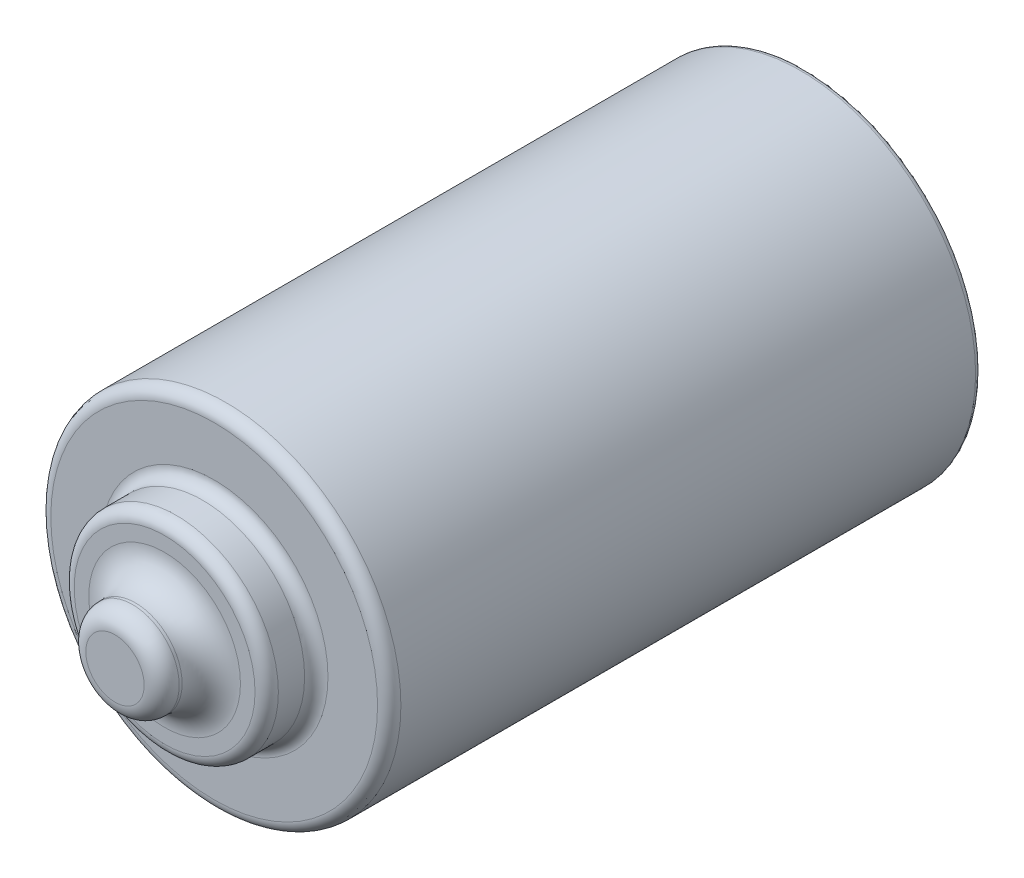
ISO-10303-21;
HEADER;
FILE_DESCRIPTION(('STEP AP214'),'2;1');
FILE_NAME('part.step','',(''),(''),'','','');
FILE_SCHEMA(('AUTOMOTIVE_DESIGN { 1 0 10303 214 1 1 1 1 }'));
ENDSEC;
DATA;
#1=APPLICATION_CONTEXT('core data for automotive mechanical design processes');
#2=APPLICATION_PROTOCOL_DEFINITION('international standard','automotive_design',2000,#1);
#3=PRODUCT_CONTEXT('',#1,'mechanical');
#4=PRODUCT('Part','Part','',(#3));
#5=PRODUCT_RELATED_PRODUCT_CATEGORY('part','',(#4));
#6=PRODUCT_DEFINITION_FORMATION('','',#4);
#7=PRODUCT_DEFINITION_CONTEXT('part definition',#1,'design');
#8=PRODUCT_DEFINITION('design','',#6,#7);
#9=PRODUCT_DEFINITION_SHAPE('','',#8);
#10=(LENGTH_UNIT() NAMED_UNIT(*) SI_UNIT(.MILLI.,.METRE.));
#11=(NAMED_UNIT(*) PLANE_ANGLE_UNIT() SI_UNIT($,.RADIAN.));
#12=(NAMED_UNIT(*) SI_UNIT($,.STERADIAN.) SOLID_ANGLE_UNIT());
#13=UNCERTAINTY_MEASURE_WITH_UNIT(LENGTH_MEASURE(1.E-05),#10,'distance_accuracy_value','');
#14=(GEOMETRIC_REPRESENTATION_CONTEXT(3) GLOBAL_UNCERTAINTY_ASSIGNED_CONTEXT((#13)) GLOBAL_UNIT_ASSIGNED_CONTEXT((#10,
#11,#12)) REPRESENTATION_CONTEXT('',''));
#15=CARTESIAN_POINT('',(0.,0.,0.));
#16=DIRECTION('',(0.,0.,1.));
#17=DIRECTION('',(1.,0.,0.));
#18=AXIS2_PLACEMENT_3D('',#15,#16,#17);
#19=CARTESIAN_POINT('',(0.,0.,101.5));
#20=DIRECTION('',(0.,0.,-1.));
#21=DIRECTION('',(-1.,0.,0.));
#22=AXIS2_PLACEMENT_3D('',#19,#20,#21);
#23=CYLINDRICAL_SURFACE('',#22,30.);
#24=CARTESIAN_POINT('',(0.,0.,1.));
#25=DIRECTION('',(0.,0.,1.));
#26=DIRECTION('',(1.,0.,0.));
#27=AXIS2_PLACEMENT_3D('',#24,#25,#26);
#28=CIRCLE('',#27,30.);
#29=CARTESIAN_POINT('',(30.,0.,1.));
#30=VERTEX_POINT('',#29);
#31=EDGE_CURVE('E58',#30,#30,#28,.T.);
#32=ORIENTED_EDGE('',*,*,#31,.T.);
#33=EDGE_LOOP('',(#32));
#34=FACE_BOUND('',#33,.T.);
#35=CARTESIAN_POINT('',(0.,0.,99.5));
#36=DIRECTION('',(0.,0.,1.));
#37=DIRECTION('',(1.,0.,0.));
#38=AXIS2_PLACEMENT_3D('',#35,#36,#37);
#39=CIRCLE('',#38,30.);
#40=CARTESIAN_POINT('',(30.,0.,99.5));
#41=VERTEX_POINT('',#40);
#42=EDGE_CURVE('E96',#41,#41,#39,.F.);
#43=ORIENTED_EDGE('',*,*,#42,.T.);
#44=EDGE_LOOP('',(#43));
#45=FACE_BOUND('',#44,.T.);
#46=ADVANCED_FACE('F40',(#34,#45),#23,.T.);
#47=CARTESIAN_POINT('',(0.,0.,101.5));
#48=DIRECTION('',(0.,0.,1.));
#49=DIRECTION('',(1.,0.,0.));
#50=AXIS2_PLACEMENT_3D('',#47,#48,#49);
#51=PLANE('',#50);
#52=CARTESIAN_POINT('',(0.,0.,101.5));
#53=DIRECTION('',(0.,0.,1.));
#54=DIRECTION('',(1.,0.,0.));
#55=AXIS2_PLACEMENT_3D('',#52,#53,#54);
#56=CIRCLE('',#55,19.5);
#57=CARTESIAN_POINT('',(19.5,0.,101.5));
#58=VERTEX_POINT('',#57);
#59=EDGE_CURVE('E88',#58,#58,#56,.F.);
#60=ORIENTED_EDGE('',*,*,#59,.T.);
#61=EDGE_LOOP('',(#60));
#62=FACE_BOUND('',#61,.T.);
#63=CARTESIAN_POINT('',(0.,0.,101.5));
#64=DIRECTION('',(0.,0.,1.));
#65=DIRECTION('',(1.,0.,0.));
#66=AXIS2_PLACEMENT_3D('',#63,#64,#65);
#67=CIRCLE('',#66,28.);
#68=CARTESIAN_POINT('',(28.,0.,101.5));
#69=VERTEX_POINT('',#68);
#70=EDGE_CURVE('E100',#69,#69,#67,.T.);
#71=ORIENTED_EDGE('',*,*,#70,.T.);
#72=EDGE_LOOP('',(#71));
#73=FACE_BOUND('',#72,.T.);
#74=ADVANCED_FACE('F114',(#62,#73),#51,.T.);
#75=CARTESIAN_POINT('',(0.,0.,0.));
#76=DIRECTION('',(0.,0.,1.));
#77=DIRECTION('',(1.,0.,0.));
#78=AXIS2_PLACEMENT_3D('',#75,#76,#77);
#79=PLANE('',#78);
#80=CARTESIAN_POINT('',(0.,0.,0.));
#81=DIRECTION('',(0.,0.,1.));
#82=DIRECTION('',(1.,0.,0.));
#83=AXIS2_PLACEMENT_3D('',#80,#81,#82);
#84=CIRCLE('',#83,29.);
#85=CARTESIAN_POINT('',(29.,0.,0.));
#86=VERTEX_POINT('',#85);
#87=EDGE_CURVE('E53',#86,#86,#84,.F.);
#88=ORIENTED_EDGE('',*,*,#87,.T.);
#89=EDGE_LOOP('',(#88));
#90=FACE_BOUND('',#89,.T.);
#91=CARTESIAN_POINT('',(0.,0.,0.));
#92=DIRECTION('',(0.,0.,-1.));
#93=DIRECTION('',(-1.,0.,0.));
#94=AXIS2_PLACEMENT_3D('',#91,#92,#93);
#95=CIRCLE('',#94,16.);
#96=CARTESIAN_POINT('',(-16.,0.,0.));
#97=VERTEX_POINT('',#96);
#98=EDGE_CURVE('E104',#97,#97,#95,.T.);
#99=ORIENTED_EDGE('',*,*,#98,.F.);
#100=EDGE_LOOP('',(#99));
#101=FACE_BOUND('',#100,.T.);
#102=ADVANCED_FACE('F111',(#90,#101),#79,.F.);
#103=CARTESIAN_POINT('',(0.,0.,110.));
#104=DIRECTION('',(0.,0.,-1.));
#105=DIRECTION('',(-1.,0.,0.));
#106=AXIS2_PLACEMENT_3D('',#103,#104,#105);
#107=CYLINDRICAL_SURFACE('',#106,17.5);
#108=CARTESIAN_POINT('',(0.,0.,108.));
#109=DIRECTION('',(0.,0.,1.));
#110=DIRECTION('',(1.,0.,0.));
#111=AXIS2_PLACEMENT_3D('',#108,#109,#110);
#112=CIRCLE('',#111,17.5);
#113=CARTESIAN_POINT('',(17.5,0.,108.));
#114=VERTEX_POINT('',#113);
#115=EDGE_CURVE('E80',#114,#114,#112,.F.);
#116=ORIENTED_EDGE('',*,*,#115,.T.);
#117=EDGE_LOOP('',(#116));
#118=FACE_BOUND('',#117,.T.);
#119=CARTESIAN_POINT('',(0.,0.,103.5));
#120=DIRECTION('',(0.,0.,1.));
#121=DIRECTION('',(1.,0.,0.));
#122=AXIS2_PLACEMENT_3D('',#119,#120,#121);
#123=CIRCLE('',#122,17.5);
#124=CARTESIAN_POINT('',(17.5,0.,103.5));
#125=VERTEX_POINT('',#124);
#126=EDGE_CURVE('E92',#125,#125,#123,.T.);
#127=ORIENTED_EDGE('',*,*,#126,.T.);
#128=EDGE_LOOP('',(#127));
#129=FACE_BOUND('',#128,.T.);
#130=ADVANCED_FACE('F113',(#118,#129),#107,.T.);
#131=CARTESIAN_POINT('',(0.,0.,110.));
#132=DIRECTION('',(0.,0.,1.));
#133=DIRECTION('',(1.,0.,0.));
#134=AXIS2_PLACEMENT_3D('',#131,#132,#133);
#135=PLANE('',#134);
#136=CARTESIAN_POINT('',(0.,0.,110.));
#137=DIRECTION('',(0.,0.,1.));
#138=DIRECTION('',(1.,0.,0.));
#139=AXIS2_PLACEMENT_3D('',#136,#137,#138);
#140=CIRCLE('',#139,13.);
#141=CARTESIAN_POINT('',(13.,0.,110.));
#142=VERTEX_POINT('',#141);
#143=EDGE_CURVE('E72',#142,#142,#140,.F.);
#144=ORIENTED_EDGE('',*,*,#143,.T.);
#145=EDGE_LOOP('',(#144));
#146=FACE_BOUND('',#145,.T.);
#147=CARTESIAN_POINT('',(0.,0.,110.));
#148=DIRECTION('',(0.,0.,1.));
#149=DIRECTION('',(1.,0.,0.));
#150=AXIS2_PLACEMENT_3D('',#147,#148,#149);
#151=CIRCLE('',#150,15.5);
#152=CARTESIAN_POINT('',(15.5,0.,110.));
#153=VERTEX_POINT('',#152);
#154=EDGE_CURVE('E84',#153,#153,#151,.T.);
#155=ORIENTED_EDGE('',*,*,#154,.T.);
#156=EDGE_LOOP('',(#155));
#157=FACE_BOUND('',#156,.T.);
#158=ADVANCED_FACE('F121',(#146,#157),#135,.T.);
#159=CARTESIAN_POINT('',(0.,0.,118.5));
#160=DIRECTION('',(0.,0.,-1.));
#161=DIRECTION('',(-1.,0.,0.));
#162=AXIS2_PLACEMENT_3D('',#159,#160,#161);
#163=CYLINDRICAL_SURFACE('',#162,8.);
#164=CARTESIAN_POINT('',(0.,0.,115.5));
#165=DIRECTION('',(0.,0.,1.));
#166=DIRECTION('',(1.,0.,0.));
#167=AXIS2_PLACEMENT_3D('',#164,#165,#166);
#168=CIRCLE('',#167,8.);
#169=CARTESIAN_POINT('',(8.,0.,115.5));
#170=VERTEX_POINT('',#169);
#171=EDGE_CURVE('E64',#170,#170,#168,.F.);
#172=ORIENTED_EDGE('',*,*,#171,.T.);
#173=EDGE_LOOP('',(#172));
#174=FACE_BOUND('',#173,.T.);
#175=CARTESIAN_POINT('',(0.,0.,115.));
#176=DIRECTION('',(0.,0.,1.));
#177=DIRECTION('',(1.,0.,0.));
#178=AXIS2_PLACEMENT_3D('',#175,#176,#177);
#179=CIRCLE('',#178,8.);
#180=CARTESIAN_POINT('',(8.,0.,115.));
#181=VERTEX_POINT('',#180);
#182=EDGE_CURVE('E76',#181,#181,#179,.T.);
#183=ORIENTED_EDGE('',*,*,#182,.T.);
#184=EDGE_LOOP('',(#183));
#185=FACE_BOUND('',#184,.T.);
#186=ADVANCED_FACE('F221',(#174,#185),#163,.T.);
#187=CARTESIAN_POINT('',(0.,0.,118.5));
#188=DIRECTION('',(0.,0.,1.));
#189=DIRECTION('',(1.,0.,0.));
#190=AXIS2_PLACEMENT_3D('',#187,#188,#189);
#191=PLANE('',#190);
#192=CARTESIAN_POINT('',(0.,0.,118.5));
#193=DIRECTION('',(0.,0.,1.));
#194=DIRECTION('',(1.,0.,0.));
#195=AXIS2_PLACEMENT_3D('',#192,#193,#194);
#196=CIRCLE('',#195,5.);
#197=CARTESIAN_POINT('',(5.,0.,118.5));
#198=VERTEX_POINT('',#197);
#199=EDGE_CURVE('E68',#198,#198,#196,.T.);
#200=ORIENTED_EDGE('',*,*,#199,.T.);
#201=EDGE_LOOP('',(#200));
#202=FACE_BOUND('',#201,.T.);
#203=ADVANCED_FACE('F186',(#202),#191,.T.);
#204=CARTESIAN_POINT('',(0.,0.,-2.5));
#205=DIRECTION('',(0.,0.,1.));
#206=DIRECTION('',(1.,0.,0.));
#207=AXIS2_PLACEMENT_3D('',#204,#205,#206);
#208=CYLINDRICAL_SURFACE('',#207,16.);
#209=CARTESIAN_POINT('',(0.,0.,-1.5));
#210=DIRECTION('',(0.,0.,-1.));
#211=DIRECTION('',(-1.,0.,0.));
#212=AXIS2_PLACEMENT_3D('',#209,#210,#211);
#213=CIRCLE('',#212,16.);
#214=CARTESIAN_POINT('',(-16.,0.,-1.5));
#215=VERTEX_POINT('',#214);
#216=EDGE_CURVE('E10',#215,#215,#213,.F.);
#217=ORIENTED_EDGE('',*,*,#216,.T.);
#218=EDGE_LOOP('',(#217));
#219=FACE_BOUND('',#218,.T.);
#220=ORIENTED_EDGE('',*,*,#98,.T.);
#221=EDGE_LOOP('',(#220));
#222=FACE_BOUND('',#221,.T.);
#223=ADVANCED_FACE('F109',(#219,#222),#208,.T.);
#224=CARTESIAN_POINT('',(0.,0.,-2.5));
#225=DIRECTION('',(0.,0.,-1.));
#226=DIRECTION('',(-1.,0.,0.));
#227=AXIS2_PLACEMENT_3D('',#224,#225,#226);
#228=PLANE('',#227);
#229=CARTESIAN_POINT('',(0.,0.,-2.5));
#230=DIRECTION('',(0.,0.,-1.));
#231=DIRECTION('',(-1.,0.,0.));
#232=AXIS2_PLACEMENT_3D('',#229,#230,#231);
#233=CIRCLE('',#232,15.);
#234=CARTESIAN_POINT('',(-15.,0.,-2.5));
#235=VERTEX_POINT('',#234);
#236=EDGE_CURVE('E48',#235,#235,#233,.T.);
#237=ORIENTED_EDGE('',*,*,#236,.T.);
#238=EDGE_LOOP('',(#237));
#239=FACE_BOUND('',#238,.T.);
#240=ADVANCED_FACE('F137',(#239),#228,.T.);
#241=CARTESIAN_POINT('',(0.,0.,99.5));
#242=DIRECTION('',(0.,0.,1.));
#243=DIRECTION('',(1.,0.,0.));
#244=AXIS2_PLACEMENT_3D('',#241,#242,#243);
#245=TOROIDAL_SURFACE('',#244,28.,2.);
#246=ORIENTED_EDGE('',*,*,#42,.F.);
#247=EDGE_LOOP('',(#246));
#248=FACE_BOUND('',#247,.T.);
#249=ORIENTED_EDGE('',*,*,#70,.F.);
#250=EDGE_LOOP('',(#249));
#251=FACE_BOUND('',#250,.T.);
#252=ADVANCED_FACE('F133',(#248,#251),#245,.T.);
#253=CARTESIAN_POINT('',(0.,0.,103.5));
#254=DIRECTION('',(0.,0.,1.));
#255=DIRECTION('',(1.,0.,0.));
#256=AXIS2_PLACEMENT_3D('',#253,#254,#255);
#257=TOROIDAL_SURFACE('',#256,19.5,2.);
#258=ORIENTED_EDGE('',*,*,#59,.F.);
#259=EDGE_LOOP('',(#258));
#260=FACE_BOUND('',#259,.T.);
#261=ORIENTED_EDGE('',*,*,#126,.F.);
#262=EDGE_LOOP('',(#261));
#263=FACE_BOUND('',#262,.T.);
#264=ADVANCED_FACE('F136',(#260,#263),#257,.F.);
#265=CARTESIAN_POINT('',(0.,0.,108.));
#266=DIRECTION('',(0.,0.,1.));
#267=DIRECTION('',(1.,0.,0.));
#268=AXIS2_PLACEMENT_3D('',#265,#266,#267);
#269=TOROIDAL_SURFACE('',#268,15.5,2.);
#270=ORIENTED_EDGE('',*,*,#115,.F.);
#271=EDGE_LOOP('',(#270));
#272=FACE_BOUND('',#271,.T.);
#273=ORIENTED_EDGE('',*,*,#154,.F.);
#274=EDGE_LOOP('',(#273));
#275=FACE_BOUND('',#274,.T.);
#276=ADVANCED_FACE('F141',(#272,#275),#269,.T.);
#277=CARTESIAN_POINT('',(0.,0.,115.));
#278=DIRECTION('',(0.,0.,1.));
#279=DIRECTION('',(1.,0.,0.));
#280=AXIS2_PLACEMENT_3D('',#277,#278,#279);
#281=TOROIDAL_SURFACE('',#280,13.,5.);
#282=ORIENTED_EDGE('',*,*,#143,.F.);
#283=EDGE_LOOP('',(#282));
#284=FACE_BOUND('',#283,.T.);
#285=ORIENTED_EDGE('',*,*,#182,.F.);
#286=EDGE_LOOP('',(#285));
#287=FACE_BOUND('',#286,.T.);
#288=ADVANCED_FACE('F145',(#284,#287),#281,.F.);
#289=CARTESIAN_POINT('',(0.,0.,115.5));
#290=DIRECTION('',(0.,0.,1.));
#291=DIRECTION('',(1.,0.,0.));
#292=AXIS2_PLACEMENT_3D('',#289,#290,#291);
#293=TOROIDAL_SURFACE('',#292,5.,3.);
#294=ORIENTED_EDGE('',*,*,#171,.F.);
#295=EDGE_LOOP('',(#294));
#296=FACE_BOUND('',#295,.T.);
#297=ORIENTED_EDGE('',*,*,#199,.F.);
#298=EDGE_LOOP('',(#297));
#299=FACE_BOUND('',#298,.T.);
#300=ADVANCED_FACE('F149',(#296,#299),#293,.T.);
#301=CARTESIAN_POINT('',(0.,0.,1.));
#302=DIRECTION('',(0.,0.,1.));
#303=DIRECTION('',(1.,0.,0.));
#304=AXIS2_PLACEMENT_3D('',#301,#302,#303);
#305=TOROIDAL_SURFACE('',#304,29.,1.);
#306=ORIENTED_EDGE('',*,*,#87,.F.);
#307=EDGE_LOOP('',(#306));
#308=FACE_BOUND('',#307,.T.);
#309=ORIENTED_EDGE('',*,*,#31,.F.);
#310=EDGE_LOOP('',(#309));
#311=FACE_BOUND('',#310,.T.);
#312=ADVANCED_FACE('F152',(#308,#311),#305,.T.);
#313=CARTESIAN_POINT('',(0.,0.,-1.5));
#314=DIRECTION('',(0.,0.,-1.));
#315=DIRECTION('',(-1.,0.,0.));
#316=AXIS2_PLACEMENT_3D('',#313,#314,#315);
#317=TOROIDAL_SURFACE('',#316,15.,1.);
#318=ORIENTED_EDGE('',*,*,#216,.F.);
#319=EDGE_LOOP('',(#318));
#320=FACE_BOUND('',#319,.T.);
#321=ORIENTED_EDGE('',*,*,#236,.F.);
#322=EDGE_LOOP('',(#321));
#323=FACE_BOUND('',#322,.T.);
#324=ADVANCED_FACE('F42',(#320,#323),#317,.T.);
#325=CLOSED_SHELL('',(#46,#74,#102,#130,#158,#186,#203,#223,#240,#252,#264,#276,#288,#300,#312,#324));
#326=MANIFOLD_SOLID_BREP('B2',#325);
#327=ADVANCED_BREP_SHAPE_REPRESENTATION('',(#18,#326),#14);
#328=SHAPE_DEFINITION_REPRESENTATION(#9,#327);
ENDSEC;
END-ISO-10303-21;
